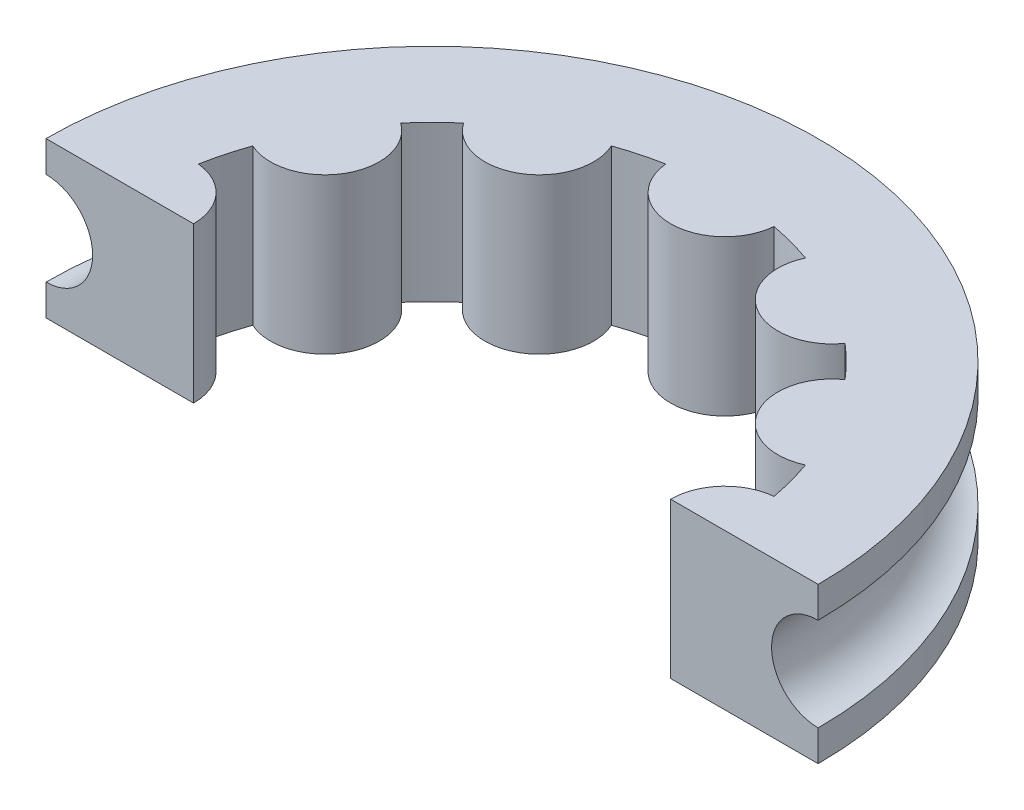
ISO-10303-21;
HEADER;
FILE_DESCRIPTION(('STEP AP214'),'2;1');
FILE_NAME('part.step','',(''),(''),'','','');
FILE_SCHEMA(('AUTOMOTIVE_DESIGN { 1 0 10303 214 1 1 1 1 }'));
ENDSEC;
DATA;
#1=APPLICATION_CONTEXT('core data for automotive mechanical design processes');
#2=APPLICATION_PROTOCOL_DEFINITION('international standard','automotive_design',2000,#1);
#3=PRODUCT_CONTEXT('',#1,'mechanical');
#4=PRODUCT('Part','Part','',(#3));
#5=PRODUCT_RELATED_PRODUCT_CATEGORY('part','',(#4));
#6=PRODUCT_DEFINITION_FORMATION('','',#4);
#7=PRODUCT_DEFINITION_CONTEXT('part definition',#1,'design');
#8=PRODUCT_DEFINITION('design','',#6,#7);
#9=PRODUCT_DEFINITION_SHAPE('','',#8);
#10=(LENGTH_UNIT() NAMED_UNIT(*) SI_UNIT(.MILLI.,.METRE.));
#11=(NAMED_UNIT(*) PLANE_ANGLE_UNIT() SI_UNIT($,.RADIAN.));
#12=(NAMED_UNIT(*) SI_UNIT($,.STERADIAN.) SOLID_ANGLE_UNIT());
#13=UNCERTAINTY_MEASURE_WITH_UNIT(LENGTH_MEASURE(1.E-05),#10,'distance_accuracy_value','');
#14=(GEOMETRIC_REPRESENTATION_CONTEXT(3) GLOBAL_UNCERTAINTY_ASSIGNED_CONTEXT((#13)) GLOBAL_UNIT_ASSIGNED_CONTEXT((#10,
#11,#12)) REPRESENTATION_CONTEXT('',''));
#15=CARTESIAN_POINT('',(0.,0.,0.));
#16=DIRECTION('',(0.,0.,1.));
#17=DIRECTION('',(1.,0.,0.));
#18=AXIS2_PLACEMENT_3D('',#15,#16,#17);
#19=CARTESIAN_POINT('',(-0.572563935418701,5.,1.24466409401336E-13));
#20=DIRECTION('',(0.,-1.,0.));
#21=DIRECTION('',(0.,0.,-1.));
#22=AXIS2_PLACEMENT_3D('',#19,#20,#21);
#23=CYLINDRICAL_SURFACE('',#22,12.4274360645813);
#24=CARTESIAN_POINT('',(-0.572563935418701,4.,0.));
#25=DIRECTION('',(0.,-1.,0.));
#26=DIRECTION('',(1.,0.,0.));
#27=AXIS2_PLACEMENT_3D('',#24,#25,#26);
#28=CIRCLE('',#27,12.4274360645813);
#29=CARTESIAN_POINT('',(-13.,4.,0.));
#30=VERTEX_POINT('',#29);
#31=CARTESIAN_POINT('',(11.8548721291626,4.,0.));
#32=VERTEX_POINT('',#31);
#33=EDGE_CURVE('E56',#30,#32,#28,.T.);
#34=ORIENTED_EDGE('',*,*,#33,.F.);
#35=DIRECTION('',(0.,-1.,0.));
#36=VECTOR('',#35,1.);
#37=CARTESIAN_POINT('',(-13.,5.,0.));
#38=LINE('',#37,#36);
#39=CARTESIAN_POINT('',(-13.,5.,0.));
#40=VERTEX_POINT('',#39);
#41=EDGE_CURVE('E186',#30,#40,#38,.F.);
#42=ORIENTED_EDGE('',*,*,#41,.T.);
#43=CARTESIAN_POINT('',(-0.572563935418701,5.,1.24466409401336E-13));
#44=DIRECTION('',(0.,1.,0.));
#45=DIRECTION('',(0.,0.,1.));
#46=AXIS2_PLACEMENT_3D('',#43,#44,#45);
#47=CIRCLE('',#46,12.4274360645813);
#48=CARTESIAN_POINT('',(11.8548721291626,5.,0.));
#49=VERTEX_POINT('',#48);
#50=EDGE_CURVE('E230',#49,#40,#47,.T.);
#51=ORIENTED_EDGE('',*,*,#50,.F.);
#52=DIRECTION('',(0.,-1.,0.));
#53=VECTOR('',#52,1.);
#54=CARTESIAN_POINT('',(11.8548721291626,5.,0.));
#55=LINE('',#54,#53);
#56=EDGE_CURVE('E181',#49,#32,#55,.T.);
#57=ORIENTED_EDGE('',*,*,#56,.T.);
#58=EDGE_LOOP('',(#34,#42,#51,#57));
#59=FACE_BOUND('',#58,.T.);
#60=ADVANCED_FACE('F41',(#59),#23,.T.);
#61=CARTESIAN_POINT('',(-0.572563935418701,0.999999999999997,0.));
#62=DIRECTION('',(0.,1.,0.));
#63=DIRECTION('',(-1.,0.,0.));
#64=AXIS2_PLACEMENT_3D('',#61,#62,#63);
#65=CIRCLE('',#64,12.4274360645813);
#66=CARTESIAN_POINT('',(11.8548721291626,1.,0.));
#67=VERTEX_POINT('',#66);
#68=CARTESIAN_POINT('',(-13.,0.999999999999995,0.));
#69=VERTEX_POINT('',#68);
#70=EDGE_CURVE('E166',#67,#69,#65,.T.);
#71=ORIENTED_EDGE('',*,*,#70,.F.);
#72=CARTESIAN_POINT('',(11.8548721291626,0.,0.));
#73=VERTEX_POINT('',#72);
#74=EDGE_CURVE('E173',#67,#73,#55,.T.);
#75=ORIENTED_EDGE('',*,*,#74,.T.);
#76=CARTESIAN_POINT('',(-0.572563935418701,0.,1.24466409401336E-13));
#77=DIRECTION('',(0.,1.,0.));
#78=DIRECTION('',(0.,0.,1.));
#79=AXIS2_PLACEMENT_3D('',#76,#77,#78);
#80=CIRCLE('',#79,12.4274360645813);
#81=CARTESIAN_POINT('',(-13.,0.,0.));
#82=VERTEX_POINT('',#81);
#83=EDGE_CURVE('E209',#73,#82,#80,.T.);
#84=ORIENTED_EDGE('',*,*,#83,.T.);
#85=EDGE_CURVE('E64',#82,#69,#38,.F.);
#86=ORIENTED_EDGE('',*,*,#85,.T.);
#87=EDGE_LOOP('',(#71,#75,#84,#86));
#88=FACE_BOUND('',#87,.T.);
#89=ADVANCED_FACE('F171',(#88),#23,.T.);
#90=CARTESIAN_POINT('',(-10.,5.,0.));
#91=DIRECTION('',(0.,-1.,0.));
#92=DIRECTION('',(0.,0.,-1.));
#93=AXIS2_PLACEMENT_3D('',#90,#91,#92);
#94=CYLINDRICAL_SURFACE('',#93,1.75);
#95=CARTESIAN_POINT('',(-10.,5.,0.));
#96=DIRECTION('',(0.,1.,0.));
#97=DIRECTION('',(0.,0.,1.));
#98=AXIS2_PLACEMENT_3D('',#95,#96,#97);
#99=CIRCLE('',#98,1.75);
#100=CARTESIAN_POINT('',(-8.25,5.,0.));
#101=VERTEX_POINT('',#100);
#102=CARTESIAN_POINT('',(-9.83757513819127,5.,-1.7424460290828));
#103=VERTEX_POINT('',#102);
#104=EDGE_CURVE('E206',#101,#103,#99,.T.);
#105=ORIENTED_EDGE('',*,*,#104,.F.);
#106=DIRECTION('',(0.,-1.,0.));
#107=VECTOR('',#106,1.);
#108=CARTESIAN_POINT('',(-8.25,5.,0.));
#109=LINE('',#108,#107);
#110=CARTESIAN_POINT('',(-8.25,0.,0.));
#111=VERTEX_POINT('',#110);
#112=EDGE_CURVE('E193',#101,#111,#109,.T.);
#113=ORIENTED_EDGE('',*,*,#112,.T.);
#114=CARTESIAN_POINT('',(-10.,0.,0.));
#115=DIRECTION('',(0.,1.,0.));
#116=DIRECTION('',(0.,0.,1.));
#117=AXIS2_PLACEMENT_3D('',#114,#115,#116);
#118=CIRCLE('',#117,1.75);
#119=CARTESIAN_POINT('',(-9.83757513819127,0.,-1.7424460290828));
#120=VERTEX_POINT('',#119);
#121=EDGE_CURVE('E197',#111,#120,#118,.T.);
#122=ORIENTED_EDGE('',*,*,#121,.T.);
#123=DIRECTION('',(0.,-1.,0.));
#124=VECTOR('',#123,1.);
#125=CARTESIAN_POINT('',(-9.83757513819127,5.,-1.7424460290828));
#126=LINE('',#125,#124);
#127=EDGE_CURVE('E304',#103,#120,#126,.T.);
#128=ORIENTED_EDGE('',*,*,#127,.F.);
#129=EDGE_LOOP('',(#105,#113,#122,#128));
#130=FACE_BOUND('',#129,.T.);
#131=ADVANCED_FACE('F43',(#130),#94,.T.);
#132=CARTESIAN_POINT('',(-0.572563935418701,5.,1.24466409401336E-13));
#133=DIRECTION('',(0.,-1.,0.));
#134=DIRECTION('',(0.,0.,-1.));
#135=AXIS2_PLACEMENT_3D('',#132,#133,#134);
#136=CYLINDRICAL_SURFACE('',#135,9.4274360645813);
#137=CARTESIAN_POINT('',(-0.572563935418701,0.,1.24466409401336E-13));
#138=DIRECTION('',(0.,1.,0.));
#139=DIRECTION('',(0.,0.,1.));
#140=AXIS2_PLACEMENT_3D('',#137,#138,#139);
#141=CIRCLE('',#140,9.4274360645813);
#142=CARTESIAN_POINT('',(-9.46752201790854,0.,-3.12350307547727));
#143=VERTEX_POINT('',#142);
#144=EDGE_CURVE('E242',#143,#120,#141,.T.);
#145=ORIENTED_EDGE('',*,*,#144,.F.);
#146=DIRECTION('',(0.,-1.,0.));
#147=VECTOR('',#146,1.);
#148=CARTESIAN_POINT('',(-9.46752201790854,5.,-3.12350307547727));
#149=LINE('',#148,#147);
#150=CARTESIAN_POINT('',(-9.46752201790854,5.,-3.12350307547727));
#151=VERTEX_POINT('',#150);
#152=EDGE_CURVE('E301',#151,#143,#149,.T.);
#153=ORIENTED_EDGE('',*,*,#152,.F.);
#154=CARTESIAN_POINT('',(-0.572563935418701,5.,1.24466409401336E-13));
#155=DIRECTION('',(0.,1.,0.));
#156=DIRECTION('',(0.,0.,1.));
#157=AXIS2_PLACEMENT_3D('',#154,#155,#156);
#158=CIRCLE('',#157,9.4274360645813);
#159=EDGE_CURVE('E205',#151,#103,#158,.T.);
#160=ORIENTED_EDGE('',*,*,#159,.T.);
#161=ORIENTED_EDGE('',*,*,#127,.T.);
#162=EDGE_LOOP('',(#145,#153,#160,#161));
#163=FACE_BOUND('',#162,.T.);
#164=ADVANCED_FACE('F349',(#163),#136,.F.);
#165=CARTESIAN_POINT('',(-8.73696305989963,5.,-4.71371803229064));
#166=DIRECTION('',(0.,-1.,0.));
#167=DIRECTION('',(0.,0.,-1.));
#168=AXIS2_PLACEMENT_3D('',#165,#166,#167);
#169=CYLINDRICAL_SURFACE('',#168,1.75);
#170=CARTESIAN_POINT('',(-8.73696305989963,0.,-4.71371803229064));
#171=DIRECTION('',(0.,1.,0.));
#172=DIRECTION('',(0.,0.,1.));
#173=AXIS2_PLACEMENT_3D('',#170,#171,#172);
#174=CIRCLE('',#173,1.75);
#175=CARTESIAN_POINT('',(-7.7250759888257,0.,-6.1415081272953));
#176=VERTEX_POINT('',#175);
#177=EDGE_CURVE('E245',#143,#176,#174,.T.);
#178=ORIENTED_EDGE('',*,*,#177,.T.);
#179=DIRECTION('',(0.,-1.,0.));
#180=VECTOR('',#179,1.);
#181=CARTESIAN_POINT('',(-7.7250759888257,5.,-6.1415081272953));
#182=LINE('',#181,#180);
#183=CARTESIAN_POINT('',(-7.7250759888257,5.,-6.1415081272953));
#184=VERTEX_POINT('',#183);
#185=EDGE_CURVE('E298',#184,#176,#182,.T.);
#186=ORIENTED_EDGE('',*,*,#185,.F.);
#187=CARTESIAN_POINT('',(-8.73696305989963,5.,-4.71371803229064));
#188=DIRECTION('',(0.,1.,0.));
#189=DIRECTION('',(0.,0.,1.));
#190=AXIS2_PLACEMENT_3D('',#187,#188,#189);
#191=CIRCLE('',#190,1.75);
#192=EDGE_CURVE('E210',#151,#184,#191,.T.);
#193=ORIENTED_EDGE('',*,*,#192,.F.);
#194=ORIENTED_EDGE('',*,*,#152,.T.);
#195=EDGE_LOOP('',(#178,#186,#193,#194));
#196=FACE_BOUND('',#195,.T.);
#197=ADVANCED_FACE('F396',(#196),#169,.T.);
#198=CARTESIAN_POINT('',(-6.71407206271393,0.,-7.15251205340704));
#199=VERTEX_POINT('',#198);
#200=EDGE_CURVE('E249',#199,#176,#141,.T.);
#201=ORIENTED_EDGE('',*,*,#200,.F.);
#202=DIRECTION('',(0.,-1.,0.));
#203=VECTOR('',#202,1.);
#204=CARTESIAN_POINT('',(-6.71407206271393,5.,-7.15251205340704));
#205=LINE('',#204,#203);
#206=CARTESIAN_POINT('',(-6.71407206271393,5.,-7.15251205340704));
#207=VERTEX_POINT('',#206);
#208=EDGE_CURVE('E295',#207,#199,#205,.T.);
#209=ORIENTED_EDGE('',*,*,#208,.F.);
#210=EDGE_CURVE('E213',#207,#184,#158,.T.);
#211=ORIENTED_EDGE('',*,*,#210,.T.);
#212=ORIENTED_EDGE('',*,*,#185,.T.);
#213=EDGE_LOOP('',(#201,#209,#211,#212));
#214=FACE_BOUND('',#213,.T.);
#215=ADVANCED_FACE('F397',(#214),#136,.F.);
#216=CARTESIAN_POINT('',(-5.28628196770924,5.,-8.16439912448094));
#217=DIRECTION('',(0.,-1.,0.));
#218=DIRECTION('',(0.,0.,-1.));
#219=AXIS2_PLACEMENT_3D('',#216,#217,#218);
#220=CYLINDRICAL_SURFACE('',#219,1.75);
#221=CARTESIAN_POINT('',(-5.28628196770924,0.,-8.16439912448094));
#222=DIRECTION('',(0.,1.,0.));
#223=DIRECTION('',(0.,0.,1.));
#224=AXIS2_PLACEMENT_3D('',#221,#222,#223);
#225=CIRCLE('',#224,1.75);
#226=CARTESIAN_POINT('',(-3.69606701089586,0.,-8.8949580824898));
#227=VERTEX_POINT('',#226);
#228=EDGE_CURVE('E250',#199,#227,#225,.T.);
#229=ORIENTED_EDGE('',*,*,#228,.T.);
#230=DIRECTION('',(0.,-1.,0.));
#231=VECTOR('',#230,1.);
#232=CARTESIAN_POINT('',(-3.69606701089586,5.,-8.8949580824898));
#233=LINE('',#232,#231);
#234=CARTESIAN_POINT('',(-3.69606701089586,5.,-8.8949580824898));
#235=VERTEX_POINT('',#234);
#236=EDGE_CURVE('E292',#235,#227,#233,.T.);
#237=ORIENTED_EDGE('',*,*,#236,.F.);
#238=CARTESIAN_POINT('',(-5.28628196770924,5.,-8.16439912448094));
#239=DIRECTION('',(0.,1.,0.));
#240=DIRECTION('',(0.,0.,1.));
#241=AXIS2_PLACEMENT_3D('',#238,#239,#240);
#242=CIRCLE('',#241,1.75);
#243=EDGE_CURVE('E214',#207,#235,#242,.T.);
#244=ORIENTED_EDGE('',*,*,#243,.F.);
#245=ORIENTED_EDGE('',*,*,#208,.T.);
#246=EDGE_LOOP('',(#229,#237,#244,#245));
#247=FACE_BOUND('',#246,.T.);
#248=ADVANCED_FACE('F460',(#247),#220,.T.);
#249=CARTESIAN_POINT('',(-2.31500996450138,0.,-9.2650112027725));
#250=VERTEX_POINT('',#249);
#251=EDGE_CURVE('E254',#250,#227,#141,.T.);
#252=ORIENTED_EDGE('',*,*,#251,.F.);
#253=DIRECTION('',(0.,-1.,0.));
#254=VECTOR('',#253,1.);
#255=CARTESIAN_POINT('',(-2.31500996450138,5.,-9.2650112027725));
#256=LINE('',#255,#254);
#257=CARTESIAN_POINT('',(-2.31500996450138,5.,-9.2650112027725));
#258=VERTEX_POINT('',#257);
#259=EDGE_CURVE('E289',#258,#250,#256,.T.);
#260=ORIENTED_EDGE('',*,*,#259,.F.);
#261=EDGE_CURVE('E217',#258,#235,#158,.T.);
#262=ORIENTED_EDGE('',*,*,#261,.T.);
#263=ORIENTED_EDGE('',*,*,#236,.T.);
#264=EDGE_LOOP('',(#252,#260,#262,#263));
#265=FACE_BOUND('',#264,.T.);
#266=ADVANCED_FACE('F462',(#265),#136,.F.);
#267=CARTESIAN_POINT('',(-0.572563935418576,5.,-9.42743606458117));
#268=DIRECTION('',(0.,-1.,0.));
#269=DIRECTION('',(0.,0.,-1.));
#270=AXIS2_PLACEMENT_3D('',#267,#268,#269);
#271=CYLINDRICAL_SURFACE('',#270,1.75);
#272=CARTESIAN_POINT('',(-0.572563935418576,0.,-9.42743606458117));
#273=DIRECTION('',(0.,1.,0.));
#274=DIRECTION('',(0.,0.,1.));
#275=AXIS2_PLACEMENT_3D('',#272,#273,#274);
#276=CIRCLE('',#275,1.75);
#277=CARTESIAN_POINT('',(1.16988209366422,0.,-9.26501120277245));
#278=VERTEX_POINT('',#277);
#279=EDGE_CURVE('E255',#250,#278,#276,.T.);
#280=ORIENTED_EDGE('',*,*,#279,.T.);
#281=DIRECTION('',(0.,-1.,0.));
#282=VECTOR('',#281,1.);
#283=CARTESIAN_POINT('',(1.16988209366422,5.,-9.26501120277245));
#284=LINE('',#283,#282);
#285=CARTESIAN_POINT('',(1.16988209366422,5.,-9.26501120277245));
#286=VERTEX_POINT('',#285);
#287=EDGE_CURVE('E286',#286,#278,#284,.T.);
#288=ORIENTED_EDGE('',*,*,#287,.F.);
#289=CARTESIAN_POINT('',(-0.572563935418576,5.,-9.42743606458117));
#290=DIRECTION('',(0.,1.,0.));
#291=DIRECTION('',(0.,0.,1.));
#292=AXIS2_PLACEMENT_3D('',#289,#290,#291);
#293=CIRCLE('',#292,1.75);
#294=EDGE_CURVE('E218',#258,#286,#293,.T.);
#295=ORIENTED_EDGE('',*,*,#294,.F.);
#296=ORIENTED_EDGE('',*,*,#259,.T.);
#297=EDGE_LOOP('',(#280,#288,#295,#296));
#298=FACE_BOUND('',#297,.T.);
#299=ADVANCED_FACE('F475',(#298),#271,.T.);
#300=CARTESIAN_POINT('',(2.55093914005869,0.,-8.89495808248972));
#301=VERTEX_POINT('',#300);
#302=EDGE_CURVE('E259',#301,#278,#141,.T.);
#303=ORIENTED_EDGE('',*,*,#302,.F.);
#304=DIRECTION('',(0.,-1.,0.));
#305=VECTOR('',#304,1.);
#306=CARTESIAN_POINT('',(2.55093914005869,5.,-8.89495808248972));
#307=LINE('',#306,#305);
#308=CARTESIAN_POINT('',(2.55093914005869,5.,-8.89495808248972));
#309=VERTEX_POINT('',#308);
#310=EDGE_CURVE('E283',#309,#301,#307,.T.);
#311=ORIENTED_EDGE('',*,*,#310,.F.);
#312=EDGE_CURVE('E221',#309,#286,#158,.T.);
#313=ORIENTED_EDGE('',*,*,#312,.T.);
#314=ORIENTED_EDGE('',*,*,#287,.T.);
#315=EDGE_LOOP('',(#303,#311,#313,#314));
#316=FACE_BOUND('',#315,.T.);
#317=ADVANCED_FACE('F385',(#316),#136,.F.);
#318=CARTESIAN_POINT('',(4.14115409687206,5.,-8.16439912448081));
#319=DIRECTION('',(0.,-1.,0.));
#320=DIRECTION('',(0.,0.,-1.));
#321=AXIS2_PLACEMENT_3D('',#318,#319,#320);
#322=CYLINDRICAL_SURFACE('',#321,1.75);
#323=CARTESIAN_POINT('',(4.14115409687206,0.,-8.16439912448081));
#324=DIRECTION('',(0.,1.,0.));
#325=DIRECTION('',(0.,0.,1.));
#326=AXIS2_PLACEMENT_3D('',#323,#324,#325);
#327=CIRCLE('',#326,1.75);
#328=CARTESIAN_POINT('',(5.56894419187672,0.,-7.15251205340688));
#329=VERTEX_POINT('',#328);
#330=EDGE_CURVE('E260',#301,#329,#327,.T.);
#331=ORIENTED_EDGE('',*,*,#330,.T.);
#332=DIRECTION('',(0.,-1.,0.));
#333=VECTOR('',#332,1.);
#334=CARTESIAN_POINT('',(5.56894419187672,5.,-7.15251205340688));
#335=LINE('',#334,#333);
#336=CARTESIAN_POINT('',(5.56894419187672,5.,-7.15251205340688));
#337=VERTEX_POINT('',#336);
#338=EDGE_CURVE('E280',#337,#329,#335,.T.);
#339=ORIENTED_EDGE('',*,*,#338,.F.);
#340=CARTESIAN_POINT('',(4.14115409687206,5.,-8.16439912448081));
#341=DIRECTION('',(0.,1.,0.));
#342=DIRECTION('',(0.,0.,1.));
#343=AXIS2_PLACEMENT_3D('',#340,#341,#342);
#344=CIRCLE('',#343,1.75);
#345=EDGE_CURVE('E222',#309,#337,#344,.T.);
#346=ORIENTED_EDGE('',*,*,#345,.F.);
#347=ORIENTED_EDGE('',*,*,#310,.T.);
#348=EDGE_LOOP('',(#331,#339,#346,#347));
#349=FACE_BOUND('',#348,.T.);
#350=ADVANCED_FACE('F384',(#349),#322,.T.);
#351=CARTESIAN_POINT('',(6.57994811798847,0.,-6.14150812729511));
#352=VERTEX_POINT('',#351);
#353=EDGE_CURVE('E241',#352,#329,#141,.T.);
#354=ORIENTED_EDGE('',*,*,#353,.F.);
#355=DIRECTION('',(0.,-1.,0.));
#356=VECTOR('',#355,1.);
#357=CARTESIAN_POINT('',(6.57994811798847,5.,-6.14150812729511));
#358=LINE('',#357,#356);
#359=CARTESIAN_POINT('',(6.57994811798847,5.,-6.14150812729511));
#360=VERTEX_POINT('',#359);
#361=EDGE_CURVE('E277',#360,#352,#358,.T.);
#362=ORIENTED_EDGE('',*,*,#361,.F.);
#363=EDGE_CURVE('E204',#360,#337,#158,.T.);
#364=ORIENTED_EDGE('',*,*,#363,.T.);
#365=ORIENTED_EDGE('',*,*,#338,.T.);
#366=EDGE_LOOP('',(#354,#362,#364,#365));
#367=FACE_BOUND('',#366,.T.);
#368=ADVANCED_FACE('F328',(#367),#136,.F.);
#369=CARTESIAN_POINT('',(7.59183518906236,5.,-4.71371803229042));
#370=DIRECTION('',(0.,-1.,0.));
#371=DIRECTION('',(0.,0.,-1.));
#372=AXIS2_PLACEMENT_3D('',#369,#370,#371);
#373=CYLINDRICAL_SURFACE('',#372,1.75);
#374=CARTESIAN_POINT('',(7.59183518906236,0.,-4.71371803229042));
#375=DIRECTION('',(0.,1.,0.));
#376=DIRECTION('',(0.,0.,1.));
#377=AXIS2_PLACEMENT_3D('',#374,#375,#376);
#378=CIRCLE('',#377,1.75);
#379=CARTESIAN_POINT('',(8.32239414707123,0.,-3.12350307547703));
#380=VERTEX_POINT('',#379);
#381=EDGE_CURVE('E240',#352,#380,#378,.T.);
#382=ORIENTED_EDGE('',*,*,#381,.T.);
#383=DIRECTION('',(0.,-1.,0.));
#384=VECTOR('',#383,1.);
#385=CARTESIAN_POINT('',(8.32239414707123,5.,-3.12350307547703));
#386=LINE('',#385,#384);
#387=CARTESIAN_POINT('',(8.32239414707123,5.,-3.12350307547703));
#388=VERTEX_POINT('',#387);
#389=EDGE_CURVE('E274',#388,#380,#386,.T.);
#390=ORIENTED_EDGE('',*,*,#389,.F.);
#391=CARTESIAN_POINT('',(7.59183518906236,5.,-4.71371803229042));
#392=DIRECTION('',(0.,1.,0.));
#393=DIRECTION('',(0.,0.,1.));
#394=AXIS2_PLACEMENT_3D('',#391,#392,#393);
#395=CIRCLE('',#394,1.75);
#396=EDGE_CURVE('E203',#360,#388,#395,.T.);
#397=ORIENTED_EDGE('',*,*,#396,.F.);
#398=ORIENTED_EDGE('',*,*,#361,.T.);
#399=EDGE_LOOP('',(#382,#390,#397,#398));
#400=FACE_BOUND('',#399,.T.);
#401=ADVANCED_FACE('F376',(#400),#373,.T.);
#402=CARTESIAN_POINT('',(8.69244726735392,0.,-1.74244602908255));
#403=VERTEX_POINT('',#402);
#404=EDGE_CURVE('E235',#403,#380,#141,.T.);
#405=ORIENTED_EDGE('',*,*,#404,.F.);
#406=DIRECTION('',(0.,-1.,0.));
#407=VECTOR('',#406,1.);
#408=CARTESIAN_POINT('',(8.69244726735392,5.,-1.74244602908255));
#409=LINE('',#408,#407);
#410=CARTESIAN_POINT('',(8.69244726735392,5.,-1.74244602908255));
#411=VERTEX_POINT('',#410);
#412=EDGE_CURVE('E234',#411,#403,#409,.T.);
#413=ORIENTED_EDGE('',*,*,#412,.F.);
#414=EDGE_CURVE('E198',#411,#388,#158,.T.);
#415=ORIENTED_EDGE('',*,*,#414,.T.);
#416=ORIENTED_EDGE('',*,*,#389,.T.);
#417=EDGE_LOOP('',(#405,#413,#415,#416));
#418=FACE_BOUND('',#417,.T.);
#419=ADVANCED_FACE('F320',(#418),#136,.F.);
#420=CARTESIAN_POINT('',(8.8548721291626,5.,2.50380376076571E-13));
#421=DIRECTION('',(0.,-1.,0.));
#422=DIRECTION('',(0.,0.,-1.));
#423=AXIS2_PLACEMENT_3D('',#420,#421,#422);
#424=CYLINDRICAL_SURFACE('',#423,1.75);
#425=CARTESIAN_POINT('',(8.8548721291626,0.,2.50380376076571E-13));
#426=DIRECTION('',(0.,1.,0.));
#427=DIRECTION('',(0.,0.,1.));
#428=AXIS2_PLACEMENT_3D('',#425,#426,#427);
#429=CIRCLE('',#428,1.75);
#430=CARTESIAN_POINT('',(7.1048721291626,0.,0.));
#431=VERTEX_POINT('',#430);
#432=EDGE_CURVE('E239',#403,#431,#429,.T.);
#433=ORIENTED_EDGE('',*,*,#432,.T.);
#434=DIRECTION('',(0.,-1.,0.));
#435=VECTOR('',#434,1.);
#436=CARTESIAN_POINT('',(7.1048721291626,5.,0.));
#437=LINE('',#436,#435);
#438=CARTESIAN_POINT('',(7.1048721291626,5.,0.));
#439=VERTEX_POINT('',#438);
#440=EDGE_CURVE('E185',#431,#439,#437,.F.);
#441=ORIENTED_EDGE('',*,*,#440,.T.);
#442=CARTESIAN_POINT('',(8.8548721291626,5.,2.50380376076571E-13));
#443=DIRECTION('',(0.,1.,0.));
#444=DIRECTION('',(0.,0.,1.));
#445=AXIS2_PLACEMENT_3D('',#442,#443,#444);
#446=CIRCLE('',#445,1.75);
#447=EDGE_CURVE('E202',#411,#439,#446,.T.);
#448=ORIENTED_EDGE('',*,*,#447,.F.);
#449=ORIENTED_EDGE('',*,*,#412,.T.);
#450=EDGE_LOOP('',(#433,#441,#448,#449));
#451=FACE_BOUND('',#450,.T.);
#452=ADVANCED_FACE('F316',(#451),#424,.T.);
#453=CARTESIAN_POINT('',(0.,5.,0.));
#454=DIRECTION('',(0.,1.,0.));
#455=DIRECTION('',(0.,0.,1.));
#456=AXIS2_PLACEMENT_3D('',#453,#454,#455);
#457=PLANE('',#456);
#458=DIRECTION('',(-1.,0.,0.));
#459=VECTOR('',#458,1.);
#460=CARTESIAN_POINT('',(13.3005487157124,5.,0.));
#461=LINE('',#460,#459);
#462=EDGE_CURVE('E366',#49,#439,#461,.T.);
#463=ORIENTED_EDGE('',*,*,#462,.F.);
#464=ORIENTED_EDGE('',*,*,#50,.T.);
#465=EDGE_CURVE('E360',#101,#40,#461,.T.);
#466=ORIENTED_EDGE('',*,*,#465,.F.);
#467=ORIENTED_EDGE('',*,*,#104,.T.);
#468=ORIENTED_EDGE('',*,*,#159,.F.);
#469=ORIENTED_EDGE('',*,*,#192,.T.);
#470=ORIENTED_EDGE('',*,*,#210,.F.);
#471=ORIENTED_EDGE('',*,*,#243,.T.);
#472=ORIENTED_EDGE('',*,*,#261,.F.);
#473=ORIENTED_EDGE('',*,*,#294,.T.);
#474=ORIENTED_EDGE('',*,*,#312,.F.);
#475=ORIENTED_EDGE('',*,*,#345,.T.);
#476=ORIENTED_EDGE('',*,*,#363,.F.);
#477=ORIENTED_EDGE('',*,*,#396,.T.);
#478=ORIENTED_EDGE('',*,*,#414,.F.);
#479=ORIENTED_EDGE('',*,*,#447,.T.);
#480=EDGE_LOOP('',(#463,#464,#466,#467,#468,#469,#470,#471,#472,#473,#474,#475,#476,#477,#478,#479));
#481=FACE_BOUND('',#480,.T.);
#482=ADVANCED_FACE('F363',(#481),#457,.T.);
#483=CARTESIAN_POINT('',(0.,0.,0.));
#484=DIRECTION('',(0.,1.,0.));
#485=DIRECTION('',(0.,0.,1.));
#486=AXIS2_PLACEMENT_3D('',#483,#484,#485);
#487=PLANE('',#486);
#488=ORIENTED_EDGE('',*,*,#83,.F.);
#489=DIRECTION('',(-1.,0.,0.));
#490=VECTOR('',#489,1.);
#491=CARTESIAN_POINT('',(0.,0.,0.));
#492=LINE('',#491,#490);
#493=EDGE_CURVE('E50',#73,#431,#492,.T.);
#494=ORIENTED_EDGE('',*,*,#493,.T.);
#495=ORIENTED_EDGE('',*,*,#432,.F.);
#496=ORIENTED_EDGE('',*,*,#404,.T.);
#497=ORIENTED_EDGE('',*,*,#381,.F.);
#498=ORIENTED_EDGE('',*,*,#353,.T.);
#499=ORIENTED_EDGE('',*,*,#330,.F.);
#500=ORIENTED_EDGE('',*,*,#302,.T.);
#501=ORIENTED_EDGE('',*,*,#279,.F.);
#502=ORIENTED_EDGE('',*,*,#251,.T.);
#503=ORIENTED_EDGE('',*,*,#228,.F.);
#504=ORIENTED_EDGE('',*,*,#200,.T.);
#505=ORIENTED_EDGE('',*,*,#177,.F.);
#506=ORIENTED_EDGE('',*,*,#144,.T.);
#507=ORIENTED_EDGE('',*,*,#121,.F.);
#508=EDGE_CURVE('E307',#111,#82,#492,.T.);
#509=ORIENTED_EDGE('',*,*,#508,.T.);
#510=EDGE_LOOP('',(#488,#494,#495,#496,#497,#498,#499,#500,#501,#502,#503,#504,#505,#506,#507,#509));
#511=FACE_BOUND('',#510,.T.);
#512=ADVANCED_FACE('F313',(#511),#487,.F.);
#513=CARTESIAN_POINT('',(13.3005487157124,0.,0.));
#514=DIRECTION('',(0.,0.,-1.));
#515=DIRECTION('',(-1.,0.,0.));
#516=AXIS2_PLACEMENT_3D('',#513,#514,#515);
#517=PLANE('',#516);
#518=CARTESIAN_POINT('',(-13.,2.5,0.));
#519=DIRECTION('',(0.,0.,-1.));
#520=DIRECTION('',(-1.,0.,0.));
#521=AXIS2_PLACEMENT_3D('',#518,#519,#520);
#522=CIRCLE('',#521,1.5);
#523=EDGE_CURVE('E367',#69,#30,#522,.F.);
#524=ORIENTED_EDGE('',*,*,#523,.F.);
#525=ORIENTED_EDGE('',*,*,#85,.F.);
#526=ORIENTED_EDGE('',*,*,#508,.F.);
#527=ORIENTED_EDGE('',*,*,#112,.F.);
#528=ORIENTED_EDGE('',*,*,#465,.T.);
#529=ORIENTED_EDGE('',*,*,#41,.F.);
#530=EDGE_LOOP('',(#524,#525,#526,#527,#528,#529));
#531=FACE_BOUND('',#530,.T.);
#532=ADVANCED_FACE('F358',(#531),#517,.F.);
#533=CARTESIAN_POINT('',(11.8548721291626,2.5,0.));
#534=DIRECTION('',(0.,0.,-1.));
#535=DIRECTION('',(-1.,0.,0.));
#536=AXIS2_PLACEMENT_3D('',#533,#534,#535);
#537=CIRCLE('',#536,1.5);
#538=EDGE_CURVE('E11',#32,#67,#537,.F.);
#539=ORIENTED_EDGE('',*,*,#538,.F.);
#540=ORIENTED_EDGE('',*,*,#56,.F.);
#541=ORIENTED_EDGE('',*,*,#462,.T.);
#542=ORIENTED_EDGE('',*,*,#440,.F.);
#543=ORIENTED_EDGE('',*,*,#493,.F.);
#544=ORIENTED_EDGE('',*,*,#74,.F.);
#545=EDGE_LOOP('',(#539,#540,#541,#542,#543,#544));
#546=FACE_BOUND('',#545,.T.);
#547=ADVANCED_FACE('F177',(#546),#517,.F.);
#548=CARTESIAN_POINT('',(-0.572563935418701,2.5,0.));
#549=DIRECTION('',(0.,1.,0.));
#550=DIRECTION('',(-1.,0.,0.));
#551=AXIS2_PLACEMENT_3D('',#548,#549,#550);
#552=TOROIDAL_SURFACE('',#551,12.4274360645813,1.5);
#553=ORIENTED_EDGE('',*,*,#523,.T.);
#554=ORIENTED_EDGE('',*,*,#33,.T.);
#555=ORIENTED_EDGE('',*,*,#538,.T.);
#556=ORIENTED_EDGE('',*,*,#70,.T.);
#557=EDGE_LOOP('',(#553,#554,#555,#556));
#558=FACE_BOUND('',#557,.T.);
#559=ADVANCED_FACE('F165',(#558),#552,.F.);
#560=CLOSED_SHELL('',(#60,#89,#131,#164,#197,#215,#248,#266,#299,#317,#350,#368,#401,#419,#452,
#482,#512,#532,#547,#559));
#561=MANIFOLD_SOLID_BREP('B2',#560);
#562=ADVANCED_BREP_SHAPE_REPRESENTATION('',(#18,#561),#14);
#563=SHAPE_DEFINITION_REPRESENTATION(#9,#562);
ENDSEC;
END-ISO-10303-21;
